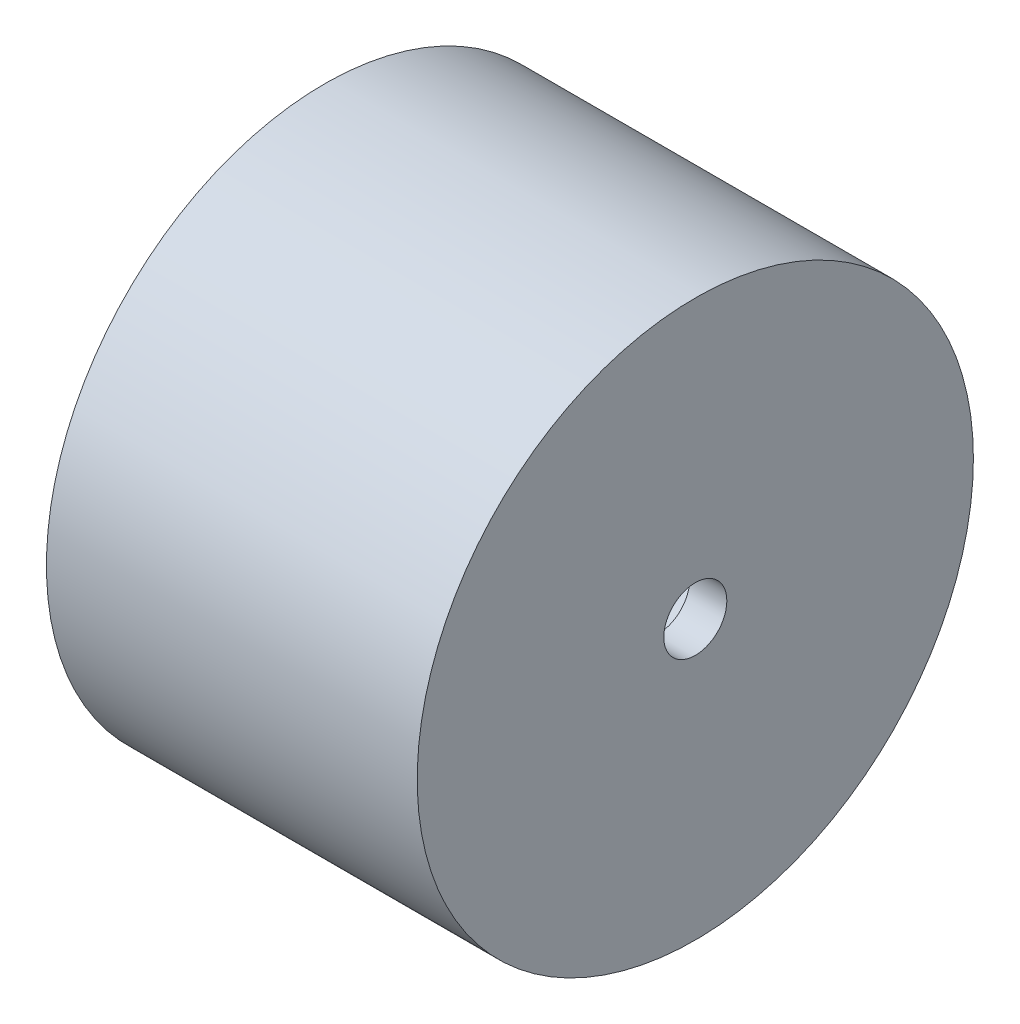
ISO-10303-21;
HEADER;
FILE_DESCRIPTION(('STEP AP214'),'2;1');
FILE_NAME('part.step','',(''),(''),'','','');
FILE_SCHEMA(('AUTOMOTIVE_DESIGN { 1 0 10303 214 1 1 1 1 }'));
ENDSEC;
DATA;
#1=APPLICATION_CONTEXT('core data for automotive mechanical design processes');
#2=APPLICATION_PROTOCOL_DEFINITION('international standard','automotive_design',2000,#1);
#3=PRODUCT_CONTEXT('',#1,'mechanical');
#4=PRODUCT('Part','Part','',(#3));
#5=PRODUCT_RELATED_PRODUCT_CATEGORY('part','',(#4));
#6=PRODUCT_DEFINITION_FORMATION('','',#4);
#7=PRODUCT_DEFINITION_CONTEXT('part definition',#1,'design');
#8=PRODUCT_DEFINITION('design','',#6,#7);
#9=PRODUCT_DEFINITION_SHAPE('','',#8);
#10=(LENGTH_UNIT() NAMED_UNIT(*) SI_UNIT(.MILLI.,.METRE.));
#11=(NAMED_UNIT(*) PLANE_ANGLE_UNIT() SI_UNIT($,.RADIAN.));
#12=(NAMED_UNIT(*) SI_UNIT($,.STERADIAN.) SOLID_ANGLE_UNIT());
#13=UNCERTAINTY_MEASURE_WITH_UNIT(LENGTH_MEASURE(1.E-05),#10,'distance_accuracy_value','');
#14=(GEOMETRIC_REPRESENTATION_CONTEXT(3) GLOBAL_UNCERTAINTY_ASSIGNED_CONTEXT((#13)) GLOBAL_UNIT_ASSIGNED_CONTEXT((#10,
#11,#12)) REPRESENTATION_CONTEXT('',''));
#15=CARTESIAN_POINT('',(0.,0.,0.));
#16=DIRECTION('',(0.,0.,1.));
#17=DIRECTION('',(1.,0.,0.));
#18=AXIS2_PLACEMENT_3D('',#15,#16,#17);
#19=CARTESIAN_POINT('',(20.,0.,0.));
#20=DIRECTION('',(-1.,0.,0.));
#21=DIRECTION('',(0.,0.,1.));
#22=AXIS2_PLACEMENT_3D('',#19,#20,#21);
#23=CYLINDRICAL_SURFACE('',#22,15.);
#24=CARTESIAN_POINT('',(20.,0.,0.));
#25=DIRECTION('',(1.,0.,0.));
#26=DIRECTION('',(0.,0.,-1.));
#27=AXIS2_PLACEMENT_3D('',#24,#25,#26);
#28=CIRCLE('',#27,15.);
#29=CARTESIAN_POINT('',(20.,0.,-15.));
#30=VERTEX_POINT('',#29);
#31=EDGE_CURVE('E10',#30,#30,#28,.T.);
#32=ORIENTED_EDGE('',*,*,#31,.F.);
#33=EDGE_LOOP('',(#32));
#34=FACE_BOUND('',#33,.T.);
#35=CARTESIAN_POINT('',(0.,0.,0.));
#36=DIRECTION('',(1.,0.,0.));
#37=DIRECTION('',(0.,0.,-1.));
#38=AXIS2_PLACEMENT_3D('',#35,#36,#37);
#39=CIRCLE('',#38,15.);
#40=CARTESIAN_POINT('',(0.,0.,-15.));
#41=VERTEX_POINT('',#40);
#42=EDGE_CURVE('E37',#41,#41,#39,.T.);
#43=ORIENTED_EDGE('',*,*,#42,.T.);
#44=EDGE_LOOP('',(#43));
#45=FACE_BOUND('',#44,.T.);
#46=ADVANCED_FACE('F34',(#34,#45),#23,.T.);
#47=CARTESIAN_POINT('',(20.,0.,0.));
#48=DIRECTION('',(1.,0.,0.));
#49=DIRECTION('',(0.,0.,-1.));
#50=AXIS2_PLACEMENT_3D('',#47,#48,#49);
#51=PLANE('',#50);
#52=CARTESIAN_POINT('',(20.,0.,0.));
#53=DIRECTION('',(1.,0.,0.));
#54=DIRECTION('',(0.,0.,-1.));
#55=AXIS2_PLACEMENT_3D('',#52,#53,#54);
#56=CIRCLE('',#55,1.7);
#57=CARTESIAN_POINT('',(20.,0.,-1.7));
#58=VERTEX_POINT('',#57);
#59=EDGE_CURVE('E52',#58,#58,#56,.T.);
#60=ORIENTED_EDGE('',*,*,#59,.F.);
#61=EDGE_LOOP('',(#60));
#62=FACE_BOUND('',#61,.T.);
#63=ORIENTED_EDGE('',*,*,#31,.T.);
#64=EDGE_LOOP('',(#63));
#65=FACE_BOUND('',#64,.T.);
#66=ADVANCED_FACE('F67',(#62,#65),#51,.T.);
#67=CARTESIAN_POINT('',(0.,0.,0.));
#68=DIRECTION('',(1.,0.,0.));
#69=DIRECTION('',(0.,0.,-1.));
#70=AXIS2_PLACEMENT_3D('',#67,#68,#69);
#71=PLANE('',#70);
#72=CARTESIAN_POINT('',(0.,0.,0.));
#73=DIRECTION('',(1.,0.,0.));
#74=DIRECTION('',(0.,0.,-1.));
#75=AXIS2_PLACEMENT_3D('',#72,#73,#74);
#76=CIRCLE('',#75,13.);
#77=CARTESIAN_POINT('',(0.,0.,-13.));
#78=VERTEX_POINT('',#77);
#79=EDGE_CURVE('E46',#78,#78,#76,.T.);
#80=ORIENTED_EDGE('',*,*,#79,.T.);
#81=EDGE_LOOP('',(#80));
#82=FACE_BOUND('',#81,.T.);
#83=ORIENTED_EDGE('',*,*,#42,.F.);
#84=EDGE_LOOP('',(#83));
#85=FACE_BOUND('',#84,.T.);
#86=ADVANCED_FACE('F69',(#82,#85),#71,.F.);
#87=CARTESIAN_POINT('',(20.,0.,0.));
#88=DIRECTION('',(-1.,0.,0.));
#89=DIRECTION('',(0.,0.,1.));
#90=AXIS2_PLACEMENT_3D('',#87,#88,#89);
#91=CYLINDRICAL_SURFACE('',#90,13.);
#92=CARTESIAN_POINT('',(18.,0.,0.));
#93=DIRECTION('',(1.,0.,0.));
#94=DIRECTION('',(0.,0.,-1.));
#95=AXIS2_PLACEMENT_3D('',#92,#93,#94);
#96=CIRCLE('',#95,13.);
#97=CARTESIAN_POINT('',(18.,0.,-13.));
#98=VERTEX_POINT('',#97);
#99=EDGE_CURVE('E44',#98,#98,#96,.T.);
#100=ORIENTED_EDGE('',*,*,#99,.T.);
#101=EDGE_LOOP('',(#100));
#102=FACE_BOUND('',#101,.T.);
#103=ORIENTED_EDGE('',*,*,#79,.F.);
#104=EDGE_LOOP('',(#103));
#105=FACE_BOUND('',#104,.T.);
#106=ADVANCED_FACE('F75',(#102,#105),#91,.F.);
#107=CARTESIAN_POINT('',(18.,0.,0.));
#108=DIRECTION('',(1.,0.,0.));
#109=DIRECTION('',(0.,0.,-1.));
#110=AXIS2_PLACEMENT_3D('',#107,#108,#109);
#111=PLANE('',#110);
#112=CARTESIAN_POINT('',(18.,0.,0.));
#113=DIRECTION('',(1.,0.,0.));
#114=DIRECTION('',(0.,0.,-1.));
#115=AXIS2_PLACEMENT_3D('',#112,#113,#114);
#116=CIRCLE('',#115,1.7);
#117=CARTESIAN_POINT('',(18.,0.,-1.7));
#118=VERTEX_POINT('',#117);
#119=EDGE_CURVE('E49',#118,#118,#116,.T.);
#120=ORIENTED_EDGE('',*,*,#119,.T.);
#121=EDGE_LOOP('',(#120));
#122=FACE_BOUND('',#121,.T.);
#123=ORIENTED_EDGE('',*,*,#99,.F.);
#124=EDGE_LOOP('',(#123));
#125=FACE_BOUND('',#124,.T.);
#126=ADVANCED_FACE('F58',(#122,#125),#111,.F.);
#127=CARTESIAN_POINT('',(18.,0.,0.));
#128=DIRECTION('',(1.,0.,0.));
#129=DIRECTION('',(0.,0.,-1.));
#130=AXIS2_PLACEMENT_3D('',#127,#128,#129);
#131=CYLINDRICAL_SURFACE('',#130,1.7);
#132=ORIENTED_EDGE('',*,*,#119,.F.);
#133=EDGE_LOOP('',(#132));
#134=FACE_BOUND('',#133,.T.);
#135=ORIENTED_EDGE('',*,*,#59,.T.);
#136=EDGE_LOOP('',(#135));
#137=FACE_BOUND('',#136,.T.);
#138=ADVANCED_FACE('F61',(#134,#137),#131,.F.);
#139=CLOSED_SHELL('',(#46,#66,#86,#106,#126,#138));
#140=MANIFOLD_SOLID_BREP('B2',#139);
#141=ADVANCED_BREP_SHAPE_REPRESENTATION('',(#18,#140),#14);
#142=SHAPE_DEFINITION_REPRESENTATION(#9,#141);
ENDSEC;
END-ISO-10303-21;
